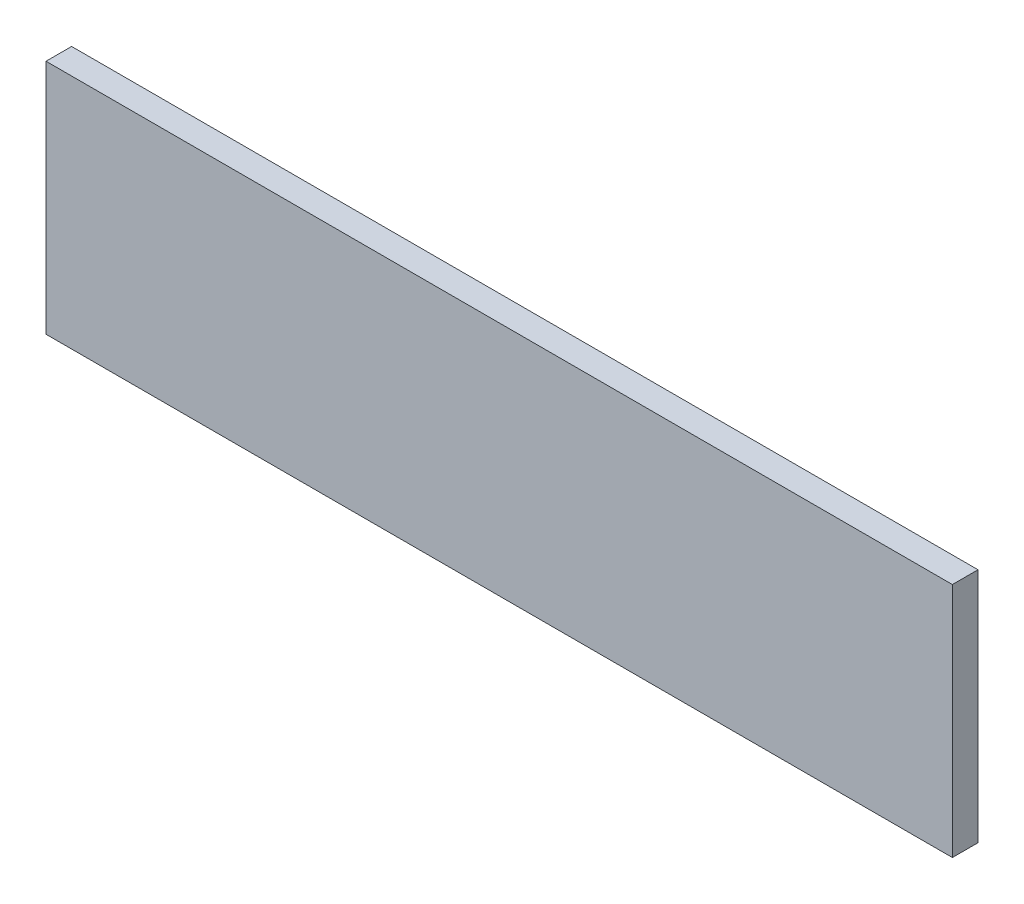
ISO-10303-21;
HEADER;
FILE_DESCRIPTION(('STEP AP214'),'2;1');
FILE_NAME('part.step','',(''),(''),'','','');
FILE_SCHEMA(('AUTOMOTIVE_DESIGN { 1 0 10303 214 1 1 1 1 }'));
ENDSEC;
DATA;
#1=APPLICATION_CONTEXT('core data for automotive mechanical design processes');
#2=APPLICATION_PROTOCOL_DEFINITION('international standard','automotive_design',2000,#1);
#3=PRODUCT_CONTEXT('',#1,'mechanical');
#4=PRODUCT('Part','Part','',(#3));
#5=PRODUCT_RELATED_PRODUCT_CATEGORY('part','',(#4));
#6=PRODUCT_DEFINITION_FORMATION('','',#4);
#7=PRODUCT_DEFINITION_CONTEXT('part definition',#1,'design');
#8=PRODUCT_DEFINITION('design','',#6,#7);
#9=PRODUCT_DEFINITION_SHAPE('','',#8);
#10=(LENGTH_UNIT() NAMED_UNIT(*) SI_UNIT(.MILLI.,.METRE.));
#11=(NAMED_UNIT(*) PLANE_ANGLE_UNIT() SI_UNIT($,.RADIAN.));
#12=(NAMED_UNIT(*) SI_UNIT($,.STERADIAN.) SOLID_ANGLE_UNIT());
#13=UNCERTAINTY_MEASURE_WITH_UNIT(LENGTH_MEASURE(1.E-05),#10,'distance_accuracy_value','');
#14=(GEOMETRIC_REPRESENTATION_CONTEXT(3) GLOBAL_UNCERTAINTY_ASSIGNED_CONTEXT((#13)) GLOBAL_UNIT_ASSIGNED_CONTEXT((#10,
#11,#12)) REPRESENTATION_CONTEXT('',''));
#15=CARTESIAN_POINT('',(0.,0.,0.));
#16=DIRECTION('',(0.,0.,1.));
#17=DIRECTION('',(1.,0.,0.));
#18=AXIS2_PLACEMENT_3D('',#15,#16,#17);
#19=CARTESIAN_POINT('',(-29.21,-7.62,1.651));
#20=DIRECTION('',(0.,1.,0.));
#21=DIRECTION('',(0.,0.,1.));
#22=AXIS2_PLACEMENT_3D('',#19,#20,#21);
#23=PLANE('',#22);
#24=DIRECTION('',(1.,0.,0.));
#25=VECTOR('',#24,1.);
#26=CARTESIAN_POINT('',(-29.21,-7.62,0.));
#27=LINE('',#26,#25);
#28=CARTESIAN_POINT('',(-29.21,-7.62,0.));
#29=VERTEX_POINT('',#28);
#30=CARTESIAN_POINT('',(29.21,-7.62,0.));
#31=VERTEX_POINT('',#30);
#32=EDGE_CURVE('E111',#29,#31,#27,.T.);
#33=ORIENTED_EDGE('',*,*,#32,.T.);
#34=DIRECTION('',(0.,0.,-1.));
#35=VECTOR('',#34,1.);
#36=CARTESIAN_POINT('',(29.21,-7.62,1.651));
#37=LINE('',#36,#35);
#38=CARTESIAN_POINT('',(29.21,-7.62,1.651));
#39=VERTEX_POINT('',#38);
#40=EDGE_CURVE('E11',#39,#31,#37,.T.);
#41=ORIENTED_EDGE('',*,*,#40,.F.);
#42=DIRECTION('',(1.,0.,0.));
#43=VECTOR('',#42,1.);
#44=CARTESIAN_POINT('',(-29.21,-7.62,1.651));
#45=LINE('',#44,#43);
#46=CARTESIAN_POINT('',(-29.21,-7.62,1.651));
#47=VERTEX_POINT('',#46);
#48=EDGE_CURVE('E93',#47,#39,#45,.T.);
#49=ORIENTED_EDGE('',*,*,#48,.F.);
#50=DIRECTION('',(0.,0.,-1.));
#51=VECTOR('',#50,1.);
#52=CARTESIAN_POINT('',(-29.21,-7.62,1.651));
#53=LINE('',#52,#51);
#54=EDGE_CURVE('E60',#47,#29,#53,.T.);
#55=ORIENTED_EDGE('',*,*,#54,.T.);
#56=EDGE_LOOP('',(#33,#41,#49,#55));
#57=FACE_BOUND('',#56,.T.);
#58=ADVANCED_FACE('F43',(#57),#23,.F.);
#59=CARTESIAN_POINT('',(29.21,-7.62,1.651));
#60=DIRECTION('',(-1.,0.,0.));
#61=DIRECTION('',(0.,0.,1.));
#62=AXIS2_PLACEMENT_3D('',#59,#60,#61);
#63=PLANE('',#62);
#64=DIRECTION('',(0.,1.,0.));
#65=VECTOR('',#64,1.);
#66=CARTESIAN_POINT('',(29.21,-7.62,0.));
#67=LINE('',#66,#65);
#68=CARTESIAN_POINT('',(29.21,7.62,0.));
#69=VERTEX_POINT('',#68);
#70=EDGE_CURVE('E99',#31,#69,#67,.T.);
#71=ORIENTED_EDGE('',*,*,#70,.T.);
#72=DIRECTION('',(0.,0.,-1.));
#73=VECTOR('',#72,1.);
#74=CARTESIAN_POINT('',(29.21,7.62,1.651));
#75=LINE('',#74,#73);
#76=CARTESIAN_POINT('',(29.21,7.62,1.651));
#77=VERTEX_POINT('',#76);
#78=EDGE_CURVE('E52',#77,#69,#75,.T.);
#79=ORIENTED_EDGE('',*,*,#78,.F.);
#80=DIRECTION('',(0.,1.,0.));
#81=VECTOR('',#80,1.);
#82=CARTESIAN_POINT('',(29.21,-7.62,1.651));
#83=LINE('',#82,#81);
#84=EDGE_CURVE('E85',#39,#77,#83,.T.);
#85=ORIENTED_EDGE('',*,*,#84,.F.);
#86=ORIENTED_EDGE('',*,*,#40,.T.);
#87=EDGE_LOOP('',(#71,#79,#85,#86));
#88=FACE_BOUND('',#87,.T.);
#89=ADVANCED_FACE('F98',(#88),#63,.F.);
#90=CARTESIAN_POINT('',(-29.21,7.62,1.651));
#91=DIRECTION('',(0.,1.,0.));
#92=DIRECTION('',(0.,0.,1.));
#93=AXIS2_PLACEMENT_3D('',#90,#91,#92);
#94=PLANE('',#93);
#95=DIRECTION('',(1.,0.,0.));
#96=VECTOR('',#95,1.);
#97=CARTESIAN_POINT('',(-29.21,7.62,0.));
#98=LINE('',#97,#96);
#99=CARTESIAN_POINT('',(-29.21,7.62,0.));
#100=VERTEX_POINT('',#99);
#101=EDGE_CURVE('E116',#100,#69,#98,.T.);
#102=ORIENTED_EDGE('',*,*,#101,.F.);
#103=DIRECTION('',(0.,0.,-1.));
#104=VECTOR('',#103,1.);
#105=CARTESIAN_POINT('',(-29.21,7.62,1.651));
#106=LINE('',#105,#104);
#107=CARTESIAN_POINT('',(-29.21,7.62,1.651));
#108=VERTEX_POINT('',#107);
#109=EDGE_CURVE('E74',#108,#100,#106,.T.);
#110=ORIENTED_EDGE('',*,*,#109,.F.);
#111=DIRECTION('',(1.,0.,0.));
#112=VECTOR('',#111,1.);
#113=CARTESIAN_POINT('',(-29.21,7.62,1.651));
#114=LINE('',#113,#112);
#115=EDGE_CURVE('E92',#108,#77,#114,.T.);
#116=ORIENTED_EDGE('',*,*,#115,.T.);
#117=ORIENTED_EDGE('',*,*,#78,.T.);
#118=EDGE_LOOP('',(#102,#110,#116,#117));
#119=FACE_BOUND('',#118,.T.);
#120=ADVANCED_FACE('F103',(#119),#94,.T.);
#121=CARTESIAN_POINT('',(-29.21,-7.62,1.651));
#122=DIRECTION('',(-1.,0.,0.));
#123=DIRECTION('',(0.,0.,1.));
#124=AXIS2_PLACEMENT_3D('',#121,#122,#123);
#125=PLANE('',#124);
#126=DIRECTION('',(0.,1.,0.));
#127=VECTOR('',#126,1.);
#128=CARTESIAN_POINT('',(-29.21,-7.62,0.));
#129=LINE('',#128,#127);
#130=EDGE_CURVE('E119',#29,#100,#129,.T.);
#131=ORIENTED_EDGE('',*,*,#130,.F.);
#132=ORIENTED_EDGE('',*,*,#54,.F.);
#133=DIRECTION('',(0.,1.,0.));
#134=VECTOR('',#133,1.);
#135=CARTESIAN_POINT('',(-29.21,-7.62,1.651));
#136=LINE('',#135,#134);
#137=EDGE_CURVE('E105',#47,#108,#136,.T.);
#138=ORIENTED_EDGE('',*,*,#137,.T.);
#139=ORIENTED_EDGE('',*,*,#109,.T.);
#140=EDGE_LOOP('',(#131,#132,#138,#139));
#141=FACE_BOUND('',#140,.T.);
#142=ADVANCED_FACE('F129',(#141),#125,.T.);
#143=CARTESIAN_POINT('',(0.,0.,1.651));
#144=DIRECTION('',(0.,0.,1.));
#145=DIRECTION('',(1.,0.,0.));
#146=AXIS2_PLACEMENT_3D('',#143,#144,#145);
#147=PLANE('',#146);
#148=ORIENTED_EDGE('',*,*,#48,.T.);
#149=ORIENTED_EDGE('',*,*,#84,.T.);
#150=ORIENTED_EDGE('',*,*,#115,.F.);
#151=ORIENTED_EDGE('',*,*,#137,.F.);
#152=EDGE_LOOP('',(#148,#149,#150,#151));
#153=FACE_BOUND('',#152,.T.);
#154=ADVANCED_FACE('F89',(#153),#147,.T.);
#155=CARTESIAN_POINT('',(0.,0.,0.));
#156=DIRECTION('',(0.,0.,1.));
#157=DIRECTION('',(1.,0.,0.));
#158=AXIS2_PLACEMENT_3D('',#155,#156,#157);
#159=PLANE('',#158);
#160=ORIENTED_EDGE('',*,*,#32,.F.);
#161=ORIENTED_EDGE('',*,*,#130,.T.);
#162=ORIENTED_EDGE('',*,*,#101,.T.);
#163=ORIENTED_EDGE('',*,*,#70,.F.);
#164=EDGE_LOOP('',(#160,#161,#162,#163));
#165=FACE_BOUND('',#164,.T.);
#166=ADVANCED_FACE('F128',(#165),#159,.F.);
#167=CLOSED_SHELL('',(#58,#89,#120,#142,#154,#166));
#168=MANIFOLD_SOLID_BREP('B2',#167);
#169=ADVANCED_BREP_SHAPE_REPRESENTATION('',(#18,#168),#14);
#170=SHAPE_DEFINITION_REPRESENTATION(#9,#169);
ENDSEC;
END-ISO-10303-21;
